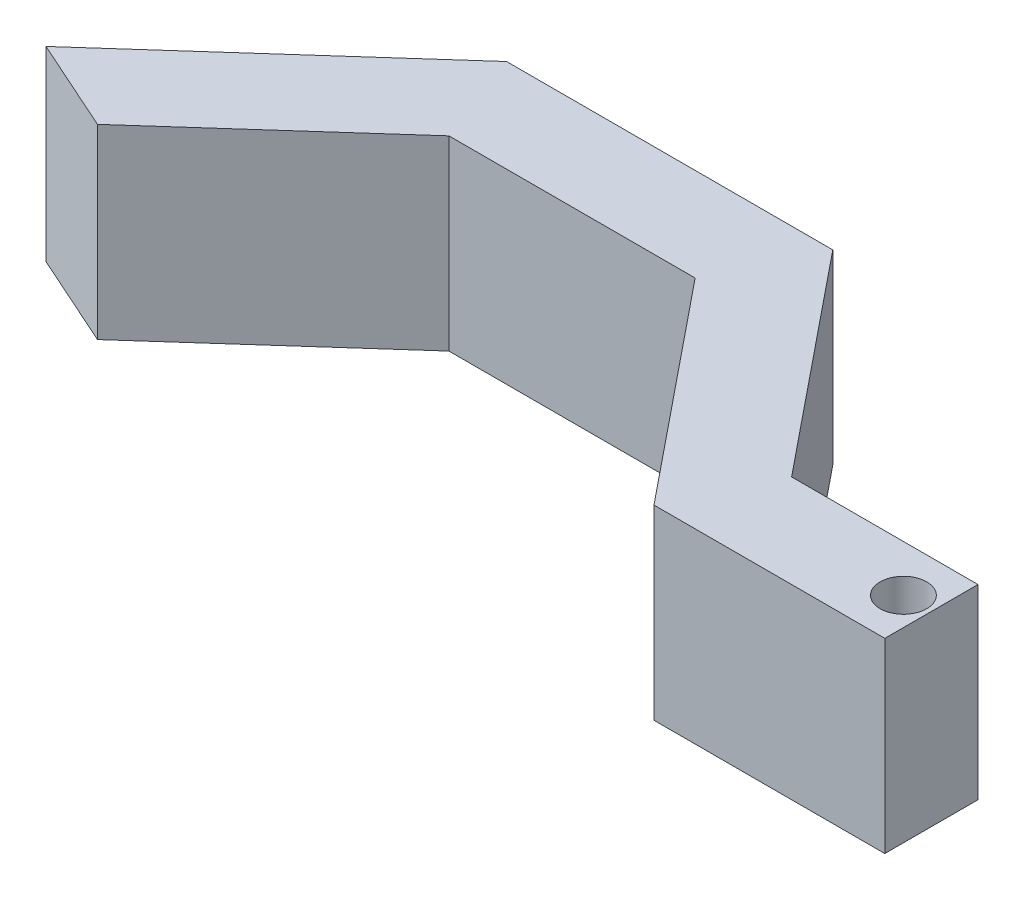
ISO-10303-21;
HEADER;
FILE_DESCRIPTION(('STEP AP214'),'2;1');
FILE_NAME('part.step','',(''),(''),'','','');
FILE_SCHEMA(('AUTOMOTIVE_DESIGN { 1 0 10303 214 1 1 1 1 }'));
ENDSEC;
DATA;
#1=APPLICATION_CONTEXT('core data for automotive mechanical design processes');
#2=APPLICATION_PROTOCOL_DEFINITION('international standard','automotive_design',2000,#1);
#3=PRODUCT_CONTEXT('',#1,'mechanical');
#4=PRODUCT('Part','Part','',(#3));
#5=PRODUCT_RELATED_PRODUCT_CATEGORY('part','',(#4));
#6=PRODUCT_DEFINITION_FORMATION('','',#4);
#7=PRODUCT_DEFINITION_CONTEXT('part definition',#1,'design');
#8=PRODUCT_DEFINITION('design','',#6,#7);
#9=PRODUCT_DEFINITION_SHAPE('','',#8);
#10=(LENGTH_UNIT() NAMED_UNIT(*) SI_UNIT(.MILLI.,.METRE.));
#11=(NAMED_UNIT(*) PLANE_ANGLE_UNIT() SI_UNIT($,.RADIAN.));
#12=(NAMED_UNIT(*) SI_UNIT($,.STERADIAN.) SOLID_ANGLE_UNIT());
#13=UNCERTAINTY_MEASURE_WITH_UNIT(LENGTH_MEASURE(1.E-05),#10,'distance_accuracy_value','');
#14=(GEOMETRIC_REPRESENTATION_CONTEXT(3) GLOBAL_UNCERTAINTY_ASSIGNED_CONTEXT((#13)) GLOBAL_UNIT_ASSIGNED_CONTEXT((#10,
#11,#12)) REPRESENTATION_CONTEXT('',''));
#15=CARTESIAN_POINT('',(0.,0.,0.));
#16=DIRECTION('',(0.,0.,1.));
#17=DIRECTION('',(1.,0.,0.));
#18=AXIS2_PLACEMENT_3D('',#15,#16,#17);
#19=CARTESIAN_POINT('',(-51.374196062884,10.01,-7.60192675795078));
#20=DIRECTION('',(0.408711157303925,0.,-0.912663787982894));
#21=DIRECTION('',(-0.912663787982894,0.,-0.408711157303925));
#22=AXIS2_PLACEMENT_3D('',#19,#20,#21);
#23=PLANE('',#22);
#24=DIRECTION('',(-0.912663787982894,0.,-0.408711157303925));
#25=VECTOR('',#24,1.);
#26=CARTESIAN_POINT('',(-5.74615347938707,10.,12.8313262486464));
#27=LINE('',#26,#25);
#28=CARTESIAN_POINT('',(-41.374196062884,10.,-3.12370418918611));
#29=VERTEX_POINT('',#28);
#30=CARTESIAN_POINT('',(-51.374196062884,10.,-7.60192675795078));
#31=VERTEX_POINT('',#30);
#32=EDGE_CURVE('E50',#29,#31,#27,.T.);
#33=ORIENTED_EDGE('',*,*,#32,.T.);
#34=DIRECTION('',(0.,1.,0.));
#35=VECTOR('',#34,1.);
#36=CARTESIAN_POINT('',(-51.374196062884,-10.,-7.60192675795078));
#37=LINE('',#36,#35);
#38=CARTESIAN_POINT('',(-51.374196062884,-10.,-7.60192675795078));
#39=VERTEX_POINT('',#38);
#40=EDGE_CURVE('E184',#39,#31,#37,.T.);
#41=ORIENTED_EDGE('',*,*,#40,.F.);
#42=DIRECTION('',(-0.912663787982894,0.,-0.408711157303925));
#43=VECTOR('',#42,1.);
#44=CARTESIAN_POINT('',(-5.74615347938707,-10.,12.8313262486464));
#45=LINE('',#44,#43);
#46=CARTESIAN_POINT('',(-41.374196062884,-10.,-3.12370418918611));
#47=VERTEX_POINT('',#46);
#48=EDGE_CURVE('E45',#47,#39,#45,.T.);
#49=ORIENTED_EDGE('',*,*,#48,.F.);
#50=DIRECTION('',(0.,1.,0.));
#51=VECTOR('',#50,1.);
#52=CARTESIAN_POINT('',(-41.374196062884,-10.,-3.12370418918611));
#53=LINE('',#52,#51);
#54=EDGE_CURVE('E11',#47,#29,#53,.T.);
#55=ORIENTED_EDGE('',*,*,#54,.T.);
#56=EDGE_LOOP('',(#33,#41,#49,#55));
#57=FACE_BOUND('',#56,.T.);
#58=ADVANCED_FACE('F42',(#57),#23,.F.);
#59=CARTESIAN_POINT('',(-26.5577639200833,-10.,-29.7531553633836));
#60=DIRECTION('',(-0.665910379790572,0.,-0.746031746031746));
#61=DIRECTION('',(-0.746031746031746,0.,0.665910379790572));
#62=AXIS2_PLACEMENT_3D('',#59,#60,#61);
#63=PLANE('',#62);
#64=ORIENTED_EDGE('',*,*,#40,.T.);
#65=DIRECTION('',(-0.746031746031746,0.,0.665910379790572));
#66=VECTOR('',#65,1.);
#67=CARTESIAN_POINT('',(-26.5577639200833,10.,-29.7531553633836));
#68=LINE('',#67,#66);
#69=CARTESIAN_POINT('',(-25.2630849517729,10.,-30.9087900506208));
#70=VERTEX_POINT('',#69);
#71=EDGE_CURVE('E160',#70,#31,#68,.T.);
#72=ORIENTED_EDGE('',*,*,#71,.F.);
#73=DIRECTION('',(0.,1.,0.));
#74=VECTOR('',#73,1.);
#75=CARTESIAN_POINT('',(-25.2630849517729,-10.,-30.9087900506208));
#76=LINE('',#75,#74);
#77=CARTESIAN_POINT('',(-25.2630849517729,-10.,-30.9087900506208));
#78=VERTEX_POINT('',#77);
#79=EDGE_CURVE('E186',#78,#70,#76,.T.);
#80=ORIENTED_EDGE('',*,*,#79,.F.);
#81=DIRECTION('',(-0.746031746031746,0.,0.665910379790572));
#82=VECTOR('',#81,1.);
#83=CARTESIAN_POINT('',(-26.5577639200833,-10.,-29.7531553633836));
#84=LINE('',#83,#82);
#85=EDGE_CURVE('E126',#78,#39,#84,.T.);
#86=ORIENTED_EDGE('',*,*,#85,.T.);
#87=EDGE_LOOP('',(#64,#72,#80,#86));
#88=FACE_BOUND('',#87,.T.);
#89=ADVANCED_FACE('F205',(#88),#63,.T.);
#90=CARTESIAN_POINT('',(0.,-10.,-30.9087900506208));
#91=DIRECTION('',(0.,0.,-1.));
#92=DIRECTION('',(-1.,0.,0.));
#93=AXIS2_PLACEMENT_3D('',#90,#91,#92);
#94=PLANE('',#93);
#95=ORIENTED_EDGE('',*,*,#79,.T.);
#96=DIRECTION('',(-1.,0.,0.));
#97=VECTOR('',#96,1.);
#98=CARTESIAN_POINT('',(0.,10.,-30.9087900506208));
#99=LINE('',#98,#97);
#100=CARTESIAN_POINT('',(9.73691504822712,10.,-30.9087900506208));
#101=VERTEX_POINT('',#100);
#102=EDGE_CURVE('E157',#101,#70,#99,.T.);
#103=ORIENTED_EDGE('',*,*,#102,.F.);
#104=DIRECTION('',(0.,1.,0.));
#105=VECTOR('',#104,1.);
#106=CARTESIAN_POINT('',(9.73691504822712,-10.,-30.9087900506208));
#107=LINE('',#106,#105);
#108=CARTESIAN_POINT('',(9.73691504822712,-10.,-30.9087900506208));
#109=VERTEX_POINT('',#108);
#110=EDGE_CURVE('E188',#109,#101,#107,.T.);
#111=ORIENTED_EDGE('',*,*,#110,.F.);
#112=DIRECTION('',(-1.,0.,0.));
#113=VECTOR('',#112,1.);
#114=CARTESIAN_POINT('',(0.,-10.,-30.9087900506208));
#115=LINE('',#114,#113);
#116=EDGE_CURVE('E179',#109,#78,#115,.T.);
#117=ORIENTED_EDGE('',*,*,#116,.T.);
#118=EDGE_LOOP('',(#95,#103,#111,#117));
#119=FACE_BOUND('',#118,.T.);
#120=ADVANCED_FACE('F208',(#119),#94,.T.);
#121=CARTESIAN_POINT('',(20.9961081869277,-10.,-17.0161531245904));
#122=DIRECTION('',(0.776895443089001,0.,-0.62962962962963));
#123=DIRECTION('',(-0.62962962962963,0.,-0.776895443089001));
#124=AXIS2_PLACEMENT_3D('',#121,#122,#123);
#125=PLANE('',#124);
#126=ORIENTED_EDGE('',*,*,#110,.T.);
#127=DIRECTION('',(-0.62962962962963,0.,-0.776895443089001));
#128=VECTOR('',#127,1.);
#129=CARTESIAN_POINT('',(20.9961081869277,10.,-17.0161531245904));
#130=LINE('',#129,#128);
#131=CARTESIAN_POINT('',(28.625803937116,10.,-7.6019267579508));
#132=VERTEX_POINT('',#131);
#133=EDGE_CURVE('E154',#132,#101,#130,.T.);
#134=ORIENTED_EDGE('',*,*,#133,.F.);
#135=DIRECTION('',(0.,1.,0.));
#136=VECTOR('',#135,1.);
#137=CARTESIAN_POINT('',(28.625803937116,-10.,-7.6019267579508));
#138=LINE('',#137,#136);
#139=CARTESIAN_POINT('',(28.625803937116,-10.,-7.6019267579508));
#140=VERTEX_POINT('',#139);
#141=EDGE_CURVE('E190',#140,#132,#138,.T.);
#142=ORIENTED_EDGE('',*,*,#141,.F.);
#143=DIRECTION('',(-0.62962962962963,0.,-0.776895443089001));
#144=VECTOR('',#143,1.);
#145=CARTESIAN_POINT('',(20.9961081869277,-10.,-17.0161531245904));
#146=LINE('',#145,#144);
#147=EDGE_CURVE('E176',#140,#109,#146,.T.);
#148=ORIENTED_EDGE('',*,*,#147,.T.);
#149=EDGE_LOOP('',(#126,#134,#142,#148));
#150=FACE_BOUND('',#149,.T.);
#151=ADVANCED_FACE('F212',(#150),#125,.T.);
#152=CARTESIAN_POINT('',(0.,-10.,-7.6019267579508));
#153=DIRECTION('',(0.,0.,-1.));
#154=DIRECTION('',(-1.,0.,0.));
#155=AXIS2_PLACEMENT_3D('',#152,#153,#154);
#156=PLANE('',#155);
#157=ORIENTED_EDGE('',*,*,#141,.T.);
#158=DIRECTION('',(-1.,0.,0.));
#159=VECTOR('',#158,1.);
#160=CARTESIAN_POINT('',(0.,10.,-7.6019267579508));
#161=LINE('',#160,#159);
#162=CARTESIAN_POINT('',(48.625803937116,10.,-7.6019267579508));
#163=VERTEX_POINT('',#162);
#164=EDGE_CURVE('E151',#163,#132,#161,.T.);
#165=ORIENTED_EDGE('',*,*,#164,.F.);
#166=DIRECTION('',(0.,1.,0.));
#167=VECTOR('',#166,1.);
#168=CARTESIAN_POINT('',(48.625803937116,-10.,-7.6019267579508));
#169=LINE('',#168,#167);
#170=CARTESIAN_POINT('',(48.625803937116,-10.,-7.6019267579508));
#171=VERTEX_POINT('',#170);
#172=EDGE_CURVE('E192',#171,#163,#169,.T.);
#173=ORIENTED_EDGE('',*,*,#172,.F.);
#174=DIRECTION('',(-1.,0.,0.));
#175=VECTOR('',#174,1.);
#176=CARTESIAN_POINT('',(0.,-10.,-7.6019267579508));
#177=LINE('',#176,#175);
#178=EDGE_CURVE('E173',#171,#140,#177,.T.);
#179=ORIENTED_EDGE('',*,*,#178,.T.);
#180=EDGE_LOOP('',(#157,#165,#173,#179));
#181=FACE_BOUND('',#180,.T.);
#182=ADVANCED_FACE('F216',(#181),#156,.T.);
#183=CARTESIAN_POINT('',(48.625803937116,-10.,0.));
#184=DIRECTION('',(1.,0.,0.));
#185=DIRECTION('',(0.,0.,-1.));
#186=AXIS2_PLACEMENT_3D('',#183,#184,#185);
#187=PLANE('',#186);
#188=ORIENTED_EDGE('',*,*,#172,.T.);
#189=DIRECTION('',(0.,0.,-1.));
#190=VECTOR('',#189,1.);
#191=CARTESIAN_POINT('',(48.625803937116,10.,0.));
#192=LINE('',#191,#190);
#193=CARTESIAN_POINT('',(48.625803937116,10.,2.3980732420492));
#194=VERTEX_POINT('',#193);
#195=EDGE_CURVE('E148',#194,#163,#192,.T.);
#196=ORIENTED_EDGE('',*,*,#195,.F.);
#197=DIRECTION('',(0.,1.,0.));
#198=VECTOR('',#197,1.);
#199=CARTESIAN_POINT('',(48.625803937116,-10.,2.3980732420492));
#200=LINE('',#199,#198);
#201=CARTESIAN_POINT('',(48.625803937116,-10.,2.3980732420492));
#202=VERTEX_POINT('',#201);
#203=EDGE_CURVE('E194',#202,#194,#200,.T.);
#204=ORIENTED_EDGE('',*,*,#203,.F.);
#205=DIRECTION('',(0.,0.,-1.));
#206=VECTOR('',#205,1.);
#207=CARTESIAN_POINT('',(48.625803937116,-10.,0.));
#208=LINE('',#207,#206);
#209=EDGE_CURVE('E170',#202,#171,#208,.T.);
#210=ORIENTED_EDGE('',*,*,#209,.T.);
#211=EDGE_LOOP('',(#188,#196,#204,#210));
#212=FACE_BOUND('',#211,.T.);
#213=ADVANCED_FACE('F220',(#212),#187,.T.);
#214=CARTESIAN_POINT('',(0.,-10.,2.3980732420492));
#215=DIRECTION('',(0.,0.,1.));
#216=DIRECTION('',(1.,0.,0.));
#217=AXIS2_PLACEMENT_3D('',#214,#215,#216);
#218=PLANE('',#217);
#219=ORIENTED_EDGE('',*,*,#203,.T.);
#220=DIRECTION('',(1.,0.,0.));
#221=VECTOR('',#220,1.);
#222=CARTESIAN_POINT('',(0.,10.,2.3980732420492));
#223=LINE('',#222,#221);
#224=CARTESIAN_POINT('',(23.8584909908881,10.,2.3980732420492));
#225=VERTEX_POINT('',#224);
#226=EDGE_CURVE('E142',#225,#194,#223,.T.);
#227=ORIENTED_EDGE('',*,*,#226,.F.);
#228=DIRECTION('',(0.,1.,0.));
#229=VECTOR('',#228,1.);
#230=CARTESIAN_POINT('',(23.8584909908881,-10.,2.3980732420492));
#231=LINE('',#230,#229);
#232=CARTESIAN_POINT('',(23.8584909908881,-10.,2.3980732420492));
#233=VERTEX_POINT('',#232);
#234=EDGE_CURVE('E196',#233,#225,#231,.T.);
#235=ORIENTED_EDGE('',*,*,#234,.F.);
#236=DIRECTION('',(1.,0.,0.));
#237=VECTOR('',#236,1.);
#238=CARTESIAN_POINT('',(0.,-10.,2.3980732420492));
#239=LINE('',#238,#237);
#240=EDGE_CURVE('E167',#233,#202,#239,.T.);
#241=ORIENTED_EDGE('',*,*,#240,.T.);
#242=EDGE_LOOP('',(#219,#227,#235,#241));
#243=FACE_BOUND('',#242,.T.);
#244=ADVANCED_FACE('F224',(#243),#218,.T.);
#245=CARTESIAN_POINT('',(13.2271537560377,-10.,-10.7198568282941));
#246=DIRECTION('',(0.776895443089001,0.,-0.62962962962963));
#247=DIRECTION('',(-0.62962962962963,0.,-0.776895443089001));
#248=AXIS2_PLACEMENT_3D('',#245,#246,#247);
#249=PLANE('',#248);
#250=ORIENTED_EDGE('',*,*,#234,.T.);
#251=DIRECTION('',(-0.62962962962963,0.,-0.776895443089001));
#252=VECTOR('',#251,1.);
#253=CARTESIAN_POINT('',(13.2271537560377,10.,-10.7198568282941));
#254=LINE('',#253,#252);
#255=CARTESIAN_POINT('',(4.96960210199915,10.,-20.9087900506208));
#256=VERTEX_POINT('',#255);
#257=EDGE_CURVE('E140',#225,#256,#254,.T.);
#258=ORIENTED_EDGE('',*,*,#257,.T.);
#259=DIRECTION('',(0.,1.,0.));
#260=VECTOR('',#259,1.);
#261=CARTESIAN_POINT('',(4.96960210199915,-10.,-20.9087900506208));
#262=LINE('',#261,#260);
#263=CARTESIAN_POINT('',(4.96960210199915,-10.,-20.9087900506208));
#264=VERTEX_POINT('',#263);
#265=EDGE_CURVE('E125',#264,#256,#262,.T.);
#266=ORIENTED_EDGE('',*,*,#265,.F.);
#267=DIRECTION('',(-0.62962962962963,0.,-0.776895443089001));
#268=VECTOR('',#267,1.);
#269=CARTESIAN_POINT('',(13.2271537560377,-10.,-10.7198568282941));
#270=LINE('',#269,#268);
#271=EDGE_CURVE('E165',#233,#264,#270,.T.);
#272=ORIENTED_EDGE('',*,*,#271,.F.);
#273=EDGE_LOOP('',(#250,#258,#266,#272));
#274=FACE_BOUND('',#273,.T.);
#275=ADVANCED_FACE('F227',(#274),#249,.F.);
#276=CARTESIAN_POINT('',(0.,-10.,-20.9087900506208));
#277=DIRECTION('',(0.,0.,-1.));
#278=DIRECTION('',(-1.,0.,0.));
#279=AXIS2_PLACEMENT_3D('',#276,#277,#278);
#280=PLANE('',#279);
#281=ORIENTED_EDGE('',*,*,#265,.T.);
#282=DIRECTION('',(-1.,0.,0.));
#283=VECTOR('',#282,1.);
#284=CARTESIAN_POINT('',(0.,10.,-20.9087900506208));
#285=LINE('',#284,#283);
#286=CARTESIAN_POINT('',(-21.4492345947905,10.,-20.9087900506208));
#287=VERTEX_POINT('',#286);
#288=EDGE_CURVE('E133',#256,#287,#285,.T.);
#289=ORIENTED_EDGE('',*,*,#288,.T.);
#290=DIRECTION('',(0.,1.,0.));
#291=VECTOR('',#290,1.);
#292=CARTESIAN_POINT('',(-21.4492345947905,-10.,-20.9087900506208));
#293=LINE('',#292,#291);
#294=CARTESIAN_POINT('',(-21.4492345947905,-10.,-20.9087900506208));
#295=VERTEX_POINT('',#294);
#296=EDGE_CURVE('E116',#295,#287,#293,.T.);
#297=ORIENTED_EDGE('',*,*,#296,.F.);
#298=DIRECTION('',(-1.,0.,0.));
#299=VECTOR('',#298,1.);
#300=CARTESIAN_POINT('',(0.,-10.,-20.9087900506208));
#301=LINE('',#300,#299);
#302=EDGE_CURVE('E163',#264,#295,#301,.T.);
#303=ORIENTED_EDGE('',*,*,#302,.F.);
#304=EDGE_LOOP('',(#281,#289,#297,#303));
#305=FACE_BOUND('',#304,.T.);
#306=ADVANCED_FACE('F138',(#305),#280,.F.);
#307=CARTESIAN_POINT('',(-19.8986601221776,-10.,-22.2928379030661));
#308=DIRECTION('',(-0.665910379790572,0.,-0.746031746031746));
#309=DIRECTION('',(-0.746031746031746,0.,0.665910379790572));
#310=AXIS2_PLACEMENT_3D('',#307,#308,#309);
#311=PLANE('',#310);
#312=ORIENTED_EDGE('',*,*,#296,.T.);
#313=DIRECTION('',(-0.746031746031746,0.,0.665910379790572));
#314=VECTOR('',#313,1.);
#315=CARTESIAN_POINT('',(-19.8986601221776,10.,-22.2928379030661));
#316=LINE('',#315,#314);
#317=EDGE_CURVE('E119',#287,#29,#316,.T.);
#318=ORIENTED_EDGE('',*,*,#317,.T.);
#319=ORIENTED_EDGE('',*,*,#54,.F.);
#320=DIRECTION('',(-0.746031746031746,0.,0.665910379790572));
#321=VECTOR('',#320,1.);
#322=CARTESIAN_POINT('',(-19.8986601221776,-10.,-22.2928379030661));
#323=LINE('',#322,#321);
#324=EDGE_CURVE('E121',#295,#47,#323,.T.);
#325=ORIENTED_EDGE('',*,*,#324,.F.);
#326=EDGE_LOOP('',(#312,#318,#319,#325));
#327=FACE_BOUND('',#326,.T.);
#328=ADVANCED_FACE('F118',(#327),#311,.F.);
#329=CARTESIAN_POINT('',(0.,-10.,0.));
#330=DIRECTION('',(0.,1.,0.));
#331=DIRECTION('',(0.,0.,1.));
#332=AXIS2_PLACEMENT_3D('',#329,#330,#331);
#333=PLANE('',#332);
#334=ORIENTED_EDGE('',*,*,#324,.T.);
#335=ORIENTED_EDGE('',*,*,#48,.T.);
#336=ORIENTED_EDGE('',*,*,#85,.F.);
#337=ORIENTED_EDGE('',*,*,#116,.F.);
#338=ORIENTED_EDGE('',*,*,#147,.F.);
#339=ORIENTED_EDGE('',*,*,#178,.F.);
#340=ORIENTED_EDGE('',*,*,#209,.F.);
#341=ORIENTED_EDGE('',*,*,#240,.F.);
#342=ORIENTED_EDGE('',*,*,#271,.T.);
#343=ORIENTED_EDGE('',*,*,#302,.T.);
#344=EDGE_LOOP('',(#334,#335,#336,#337,#338,#339,#340,#341,#342,#343));
#345=FACE_BOUND('',#344,.T.);
#346=ADVANCED_FACE('F201',(#345),#333,.F.);
#347=CARTESIAN_POINT('',(0.,10.,0.));
#348=DIRECTION('',(0.,1.,0.));
#349=DIRECTION('',(0.,0.,1.));
#350=AXIS2_PLACEMENT_3D('',#347,#348,#349);
#351=PLANE('',#350);
#352=ORIENTED_EDGE('',*,*,#32,.F.);
#353=ORIENTED_EDGE('',*,*,#317,.F.);
#354=ORIENTED_EDGE('',*,*,#288,.F.);
#355=ORIENTED_EDGE('',*,*,#257,.F.);
#356=ORIENTED_EDGE('',*,*,#226,.T.);
#357=ORIENTED_EDGE('',*,*,#195,.T.);
#358=ORIENTED_EDGE('',*,*,#164,.T.);
#359=ORIENTED_EDGE('',*,*,#133,.T.);
#360=ORIENTED_EDGE('',*,*,#102,.T.);
#361=ORIENTED_EDGE('',*,*,#71,.T.);
#362=EDGE_LOOP('',(#352,#353,#354,#355,#356,#357,#358,#359,#360,#361));
#363=FACE_BOUND('',#362,.T.);
#364=CARTESIAN_POINT('',(45.625803937116,10.,-2.6019267579508));
#365=DIRECTION('',(0.,1.,0.));
#366=DIRECTION('',(0.,0.,1.));
#367=AXIS2_PLACEMENT_3D('',#364,#365,#366);
#368=CIRCLE('',#367,2.5);
#369=CARTESIAN_POINT('',(45.625803937116,10.,-0.101926757950801));
#370=VERTEX_POINT('',#369);
#371=EDGE_CURVE('E375',#370,#370,#368,.T.);
#372=ORIENTED_EDGE('',*,*,#371,.F.);
#373=EDGE_LOOP('',(#372));
#374=FACE_BOUND('',#373,.T.);
#375=ADVANCED_FACE('F130',(#363,#374),#351,.T.);
#376=CARTESIAN_POINT('',(45.625803937116,6.,-2.6019267579508));
#377=DIRECTION('',(0.,1.,0.));
#378=DIRECTION('',(0.,0.,1.));
#379=AXIS2_PLACEMENT_3D('',#376,#377,#378);
#380=CYLINDRICAL_SURFACE('',#379,2.5);
#381=CARTESIAN_POINT('',(45.625803937116,6.,-2.6019267579508));
#382=DIRECTION('',(0.,1.,0.));
#383=DIRECTION('',(0.,0.,1.));
#384=AXIS2_PLACEMENT_3D('',#381,#382,#383);
#385=CIRCLE('',#384,2.5);
#386=CARTESIAN_POINT('',(45.625803937116,6.,-0.101926757950801));
#387=VERTEX_POINT('',#386);
#388=EDGE_CURVE('E136',#387,#387,#385,.T.);
#389=ORIENTED_EDGE('',*,*,#388,.F.);
#390=EDGE_LOOP('',(#389));
#391=FACE_BOUND('',#390,.T.);
#392=ORIENTED_EDGE('',*,*,#371,.T.);
#393=EDGE_LOOP('',(#392));
#394=FACE_BOUND('',#393,.T.);
#395=ADVANCED_FACE('F243',(#391,#394),#380,.F.);
#396=CARTESIAN_POINT('',(45.625803937116,6.,-2.6019267579508));
#397=DIRECTION('',(0.,1.,0.));
#398=DIRECTION('',(0.,0.,1.));
#399=AXIS2_PLACEMENT_3D('',#396,#397,#398);
#400=PLANE('',#399);
#401=ORIENTED_EDGE('',*,*,#388,.T.);
#402=EDGE_LOOP('',(#401));
#403=FACE_BOUND('',#402,.T.);
#404=ADVANCED_FACE('F237',(#403),#400,.T.);
#405=CLOSED_SHELL('',(#58,#89,#120,#151,#182,#213,#244,#275,#306,#328,#346,#375,#395,#404));
#406=MANIFOLD_SOLID_BREP('B2',#405);
#407=ADVANCED_BREP_SHAPE_REPRESENTATION('',(#18,#406),#14);
#408=SHAPE_DEFINITION_REPRESENTATION(#9,#407);
ENDSEC;
END-ISO-10303-21;
